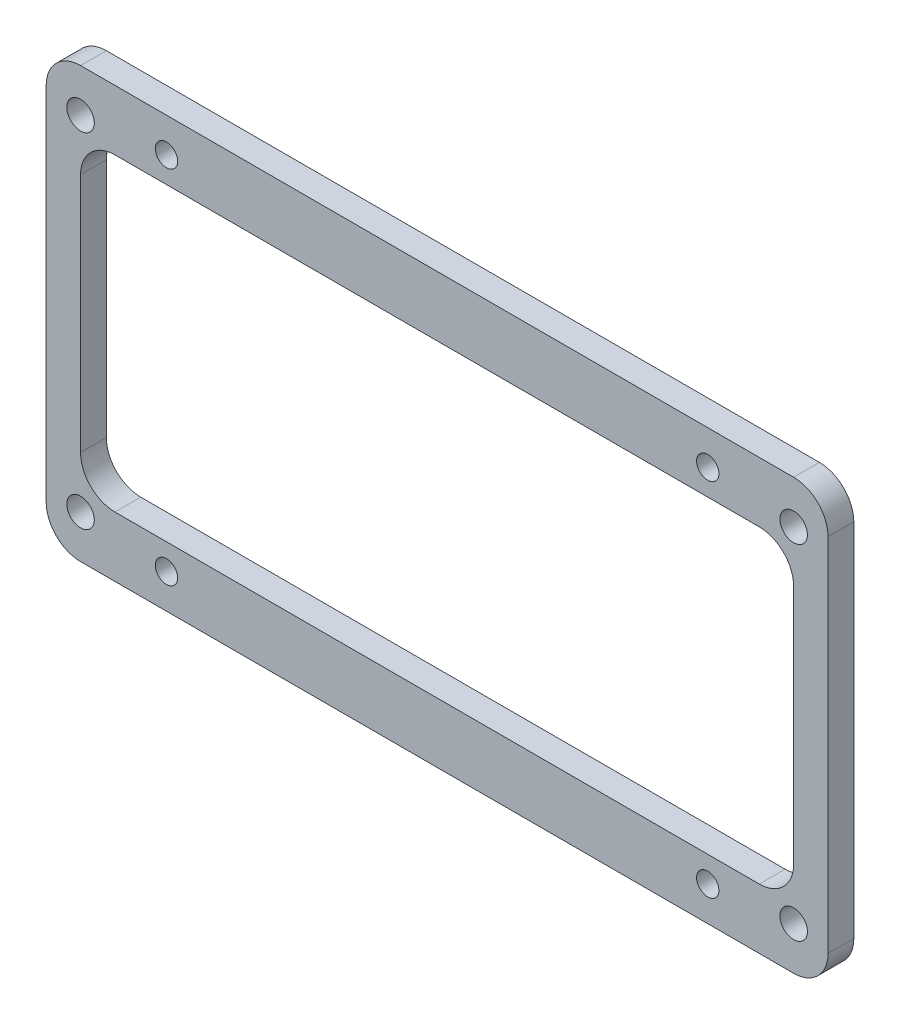
ISO-10303-21;
HEADER;
FILE_DESCRIPTION(('STEP AP214'),'2;1');
FILE_NAME('part.step','',(''),(''),'','','');
FILE_SCHEMA(('AUTOMOTIVE_DESIGN { 1 0 10303 214 1 1 1 1 }'));
ENDSEC;
DATA;
#1=APPLICATION_CONTEXT('core data for automotive mechanical design processes');
#2=APPLICATION_PROTOCOL_DEFINITION('international standard','automotive_design',2000,#1);
#3=PRODUCT_CONTEXT('',#1,'mechanical');
#4=PRODUCT('Part','Part','',(#3));
#5=PRODUCT_RELATED_PRODUCT_CATEGORY('part','',(#4));
#6=PRODUCT_DEFINITION_FORMATION('','',#4);
#7=PRODUCT_DEFINITION_CONTEXT('part definition',#1,'design');
#8=PRODUCT_DEFINITION('design','',#6,#7);
#9=PRODUCT_DEFINITION_SHAPE('','',#8);
#10=(LENGTH_UNIT() NAMED_UNIT(*) SI_UNIT(.MILLI.,.METRE.));
#11=(NAMED_UNIT(*) PLANE_ANGLE_UNIT() SI_UNIT($,.RADIAN.));
#12=(NAMED_UNIT(*) SI_UNIT($,.STERADIAN.) SOLID_ANGLE_UNIT());
#13=UNCERTAINTY_MEASURE_WITH_UNIT(LENGTH_MEASURE(1.E-05),#10,'distance_accuracy_value','');
#14=(GEOMETRIC_REPRESENTATION_CONTEXT(3) GLOBAL_UNCERTAINTY_ASSIGNED_CONTEXT((#13)) GLOBAL_UNIT_ASSIGNED_CONTEXT((#10,
#11,#12)) REPRESENTATION_CONTEXT('',''));
#15=CARTESIAN_POINT('',(0.,0.,0.));
#16=DIRECTION('',(0.,0.,1.));
#17=DIRECTION('',(1.,0.,0.));
#18=AXIS2_PLACEMENT_3D('',#15,#16,#17);
#19=CARTESIAN_POINT('',(0.,0.,3.));
#20=DIRECTION('',(0.,0.,-1.));
#21=DIRECTION('',(-1.,0.,0.));
#22=AXIS2_PLACEMENT_3D('',#19,#20,#21);
#23=PLANE('',#22);
#24=CARTESIAN_POINT('',(-41.5,20.,3.));
#25=DIRECTION('',(0.,0.,1.));
#26=DIRECTION('',(1.,0.,0.));
#27=AXIS2_PLACEMENT_3D('',#24,#25,#26);
#28=CIRCLE('',#27,1.6);
#29=CARTESIAN_POINT('',(-39.9,20.,3.));
#30=VERTEX_POINT('',#29);
#31=EDGE_CURVE('E395',#30,#30,#28,.T.);
#32=ORIENTED_EDGE('',*,*,#31,.F.);
#33=EDGE_LOOP('',(#32));
#34=FACE_BOUND('',#33,.T.);
#35=CARTESIAN_POINT('',(-41.5,-20.,3.));
#36=DIRECTION('',(0.,0.,1.));
#37=DIRECTION('',(1.,0.,0.));
#38=AXIS2_PLACEMENT_3D('',#35,#36,#37);
#39=CIRCLE('',#38,1.6);
#40=CARTESIAN_POINT('',(-39.9,-20.,3.));
#41=VERTEX_POINT('',#40);
#42=EDGE_CURVE('E401',#41,#41,#39,.T.);
#43=ORIENTED_EDGE('',*,*,#42,.F.);
#44=EDGE_LOOP('',(#43));
#45=FACE_BOUND('',#44,.T.);
#46=CARTESIAN_POINT('',(41.5,-20.,3.));
#47=DIRECTION('',(0.,0.,1.));
#48=DIRECTION('',(1.,0.,0.));
#49=AXIS2_PLACEMENT_3D('',#46,#47,#48);
#50=CIRCLE('',#49,1.6);
#51=CARTESIAN_POINT('',(43.1,-20.,3.));
#52=VERTEX_POINT('',#51);
#53=EDGE_CURVE('E407',#52,#52,#50,.T.);
#54=ORIENTED_EDGE('',*,*,#53,.F.);
#55=EDGE_LOOP('',(#54));
#56=FACE_BOUND('',#55,.T.);
#57=CARTESIAN_POINT('',(41.5,20.,3.));
#58=DIRECTION('',(0.,0.,1.));
#59=DIRECTION('',(1.,0.,0.));
#60=AXIS2_PLACEMENT_3D('',#57,#58,#59);
#61=CIRCLE('',#60,1.6);
#62=CARTESIAN_POINT('',(43.1,20.,3.));
#63=VERTEX_POINT('',#62);
#64=EDGE_CURVE('E389',#63,#63,#61,.T.);
#65=ORIENTED_EDGE('',*,*,#64,.F.);
#66=EDGE_LOOP('',(#65));
#67=FACE_BOUND('',#66,.T.);
#68=CARTESIAN_POINT('',(-31.5,21.,3.));
#69=DIRECTION('',(0.,0.,1.));
#70=DIRECTION('',(1.,0.,0.));
#71=AXIS2_PLACEMENT_3D('',#68,#69,#70);
#72=CIRCLE('',#71,1.3);
#73=CARTESIAN_POINT('',(-30.2,21.,3.));
#74=VERTEX_POINT('',#73);
#75=EDGE_CURVE('E371',#74,#74,#72,.T.);
#76=ORIENTED_EDGE('',*,*,#75,.F.);
#77=EDGE_LOOP('',(#76));
#78=FACE_BOUND('',#77,.T.);
#79=CARTESIAN_POINT('',(-31.5,-21.,3.));
#80=DIRECTION('',(0.,0.,1.));
#81=DIRECTION('',(1.,0.,0.));
#82=AXIS2_PLACEMENT_3D('',#79,#80,#81);
#83=CIRCLE('',#82,1.3);
#84=CARTESIAN_POINT('',(-30.2,-21.,3.));
#85=VERTEX_POINT('',#84);
#86=EDGE_CURVE('E378',#85,#85,#83,.T.);
#87=ORIENTED_EDGE('',*,*,#86,.F.);
#88=EDGE_LOOP('',(#87));
#89=FACE_BOUND('',#88,.T.);
#90=CARTESIAN_POINT('',(31.5,-21.,3.));
#91=DIRECTION('',(0.,0.,1.));
#92=DIRECTION('',(1.,0.,0.));
#93=AXIS2_PLACEMENT_3D('',#90,#91,#92);
#94=CIRCLE('',#93,1.3);
#95=CARTESIAN_POINT('',(32.8,-21.,3.));
#96=VERTEX_POINT('',#95);
#97=EDGE_CURVE('E384',#96,#96,#94,.T.);
#98=ORIENTED_EDGE('',*,*,#97,.F.);
#99=EDGE_LOOP('',(#98));
#100=FACE_BOUND('',#99,.T.);
#101=CARTESIAN_POINT('',(31.5,21.,3.));
#102=DIRECTION('',(0.,0.,1.));
#103=DIRECTION('',(1.,0.,0.));
#104=AXIS2_PLACEMENT_3D('',#101,#102,#103);
#105=CIRCLE('',#104,1.3);
#106=CARTESIAN_POINT('',(32.8,21.,3.));
#107=VERTEX_POINT('',#106);
#108=EDGE_CURVE('E365',#107,#107,#105,.T.);
#109=ORIENTED_EDGE('',*,*,#108,.F.);
#110=EDGE_LOOP('',(#109));
#111=FACE_BOUND('',#110,.T.);
#112=DIRECTION('',(0.,1.,0.));
#113=VECTOR('',#112,1.);
#114=CARTESIAN_POINT('',(45.5,-25.,3.));
#115=LINE('',#114,#113);
#116=CARTESIAN_POINT('',(45.5,-21.,3.));
#117=VERTEX_POINT('',#116);
#118=CARTESIAN_POINT('',(45.5,21.,3.));
#119=VERTEX_POINT('',#118);
#120=EDGE_CURVE('E264',#117,#119,#115,.T.);
#121=ORIENTED_EDGE('',*,*,#120,.T.);
#122=CARTESIAN_POINT('',(41.5,21.,3.));
#123=DIRECTION('',(0.,0.,-1.));
#124=DIRECTION('',(-1.,0.,0.));
#125=AXIS2_PLACEMENT_3D('',#122,#123,#124);
#126=CIRCLE('',#125,4.);
#127=CARTESIAN_POINT('',(41.5,25.,3.));
#128=VERTEX_POINT('',#127);
#129=EDGE_CURVE('E208',#119,#128,#126,.F.);
#130=ORIENTED_EDGE('',*,*,#129,.T.);
#131=DIRECTION('',(-1.,0.,0.));
#132=VECTOR('',#131,1.);
#133=CARTESIAN_POINT('',(-45.5,25.,3.));
#134=LINE('',#133,#132);
#135=CARTESIAN_POINT('',(-41.5,25.,3.));
#136=VERTEX_POINT('',#135);
#137=EDGE_CURVE('E266',#128,#136,#134,.T.);
#138=ORIENTED_EDGE('',*,*,#137,.T.);
#139=CARTESIAN_POINT('',(-41.5,21.,3.));
#140=DIRECTION('',(0.,0.,-1.));
#141=DIRECTION('',(-1.,0.,0.));
#142=AXIS2_PLACEMENT_3D('',#139,#140,#141);
#143=CIRCLE('',#142,4.);
#144=CARTESIAN_POINT('',(-45.5,21.,3.));
#145=VERTEX_POINT('',#144);
#146=EDGE_CURVE('E210',#136,#145,#143,.F.);
#147=ORIENTED_EDGE('',*,*,#146,.T.);
#148=DIRECTION('',(0.,-1.,0.));
#149=VECTOR('',#148,1.);
#150=CARTESIAN_POINT('',(-45.5,-25.,3.));
#151=LINE('',#150,#149);
#152=CARTESIAN_POINT('',(-45.5,-21.,3.));
#153=VERTEX_POINT('',#152);
#154=EDGE_CURVE('E170',#145,#153,#151,.T.);
#155=ORIENTED_EDGE('',*,*,#154,.T.);
#156=CARTESIAN_POINT('',(-41.5,-21.,3.));
#157=DIRECTION('',(0.,0.,-1.));
#158=DIRECTION('',(-1.,0.,0.));
#159=AXIS2_PLACEMENT_3D('',#156,#157,#158);
#160=CIRCLE('',#159,4.);
#161=CARTESIAN_POINT('',(-41.5,-25.,3.));
#162=VERTEX_POINT('',#161);
#163=EDGE_CURVE('E212',#153,#162,#160,.F.);
#164=ORIENTED_EDGE('',*,*,#163,.T.);
#165=DIRECTION('',(1.,0.,0.));
#166=VECTOR('',#165,1.);
#167=CARTESIAN_POINT('',(-45.5,-25.,3.));
#168=LINE('',#167,#166);
#169=CARTESIAN_POINT('',(41.5,-25.,3.));
#170=VERTEX_POINT('',#169);
#171=EDGE_CURVE('E166',#162,#170,#168,.T.);
#172=ORIENTED_EDGE('',*,*,#171,.T.);
#173=CARTESIAN_POINT('',(41.5,-21.,3.));
#174=DIRECTION('',(0.,0.,-1.));
#175=DIRECTION('',(-1.,0.,0.));
#176=AXIS2_PLACEMENT_3D('',#173,#174,#175);
#177=CIRCLE('',#176,4.);
#178=EDGE_CURVE('E214',#170,#117,#177,.F.);
#179=ORIENTED_EDGE('',*,*,#178,.T.);
#180=EDGE_LOOP('',(#121,#130,#138,#147,#155,#164,#172,#179));
#181=FACE_BOUND('',#180,.T.);
#182=DIRECTION('',(0.,1.,0.));
#183=VECTOR('',#182,1.);
#184=CARTESIAN_POINT('',(41.5,-18.,3.));
#185=LINE('',#184,#183);
#186=CARTESIAN_POINT('',(41.5,-14.,3.));
#187=VERTEX_POINT('',#186);
#188=CARTESIAN_POINT('',(41.5,14.,3.));
#189=VERTEX_POINT('',#188);
#190=EDGE_CURVE('E243',#187,#189,#185,.T.);
#191=ORIENTED_EDGE('',*,*,#190,.F.);
#192=CARTESIAN_POINT('',(37.5,-14.,3.));
#193=DIRECTION('',(0.,0.,-1.));
#194=DIRECTION('',(-1.,0.,0.));
#195=AXIS2_PLACEMENT_3D('',#192,#193,#194);
#196=CIRCLE('',#195,4.);
#197=CARTESIAN_POINT('',(37.5,-18.,3.));
#198=VERTEX_POINT('',#197);
#199=EDGE_CURVE('E236',#187,#198,#196,.T.);
#200=ORIENTED_EDGE('',*,*,#199,.T.);
#201=DIRECTION('',(1.,0.,0.));
#202=VECTOR('',#201,1.);
#203=CARTESIAN_POINT('',(-41.5,-18.,3.));
#204=LINE('',#203,#202);
#205=CARTESIAN_POINT('',(-37.5,-18.,3.));
#206=VERTEX_POINT('',#205);
#207=EDGE_CURVE('E273',#206,#198,#204,.T.);
#208=ORIENTED_EDGE('',*,*,#207,.F.);
#209=CARTESIAN_POINT('',(-37.5,-14.,3.));
#210=DIRECTION('',(0.,0.,-1.));
#211=DIRECTION('',(-1.,0.,0.));
#212=AXIS2_PLACEMENT_3D('',#209,#210,#211);
#213=CIRCLE('',#212,4.);
#214=CARTESIAN_POINT('',(-41.5,-14.,3.));
#215=VERTEX_POINT('',#214);
#216=EDGE_CURVE('E232',#206,#215,#213,.T.);
#217=ORIENTED_EDGE('',*,*,#216,.T.);
#218=DIRECTION('',(0.,-1.,0.));
#219=VECTOR('',#218,1.);
#220=CARTESIAN_POINT('',(-41.5,-18.,3.));
#221=LINE('',#220,#219);
#222=CARTESIAN_POINT('',(-41.5,14.,3.));
#223=VERTEX_POINT('',#222);
#224=EDGE_CURVE('E361',#223,#215,#221,.T.);
#225=ORIENTED_EDGE('',*,*,#224,.F.);
#226=CARTESIAN_POINT('',(-37.5,14.,3.));
#227=DIRECTION('',(0.,0.,-1.));
#228=DIRECTION('',(-1.,0.,0.));
#229=AXIS2_PLACEMENT_3D('',#226,#227,#228);
#230=CIRCLE('',#229,4.);
#231=CARTESIAN_POINT('',(-37.5,18.,3.));
#232=VERTEX_POINT('',#231);
#233=EDGE_CURVE('E11',#223,#232,#230,.T.);
#234=ORIENTED_EDGE('',*,*,#233,.T.);
#235=DIRECTION('',(-1.,0.,0.));
#236=VECTOR('',#235,1.);
#237=CARTESIAN_POINT('',(-41.5,18.,3.));
#238=LINE('',#237,#236);
#239=CARTESIAN_POINT('',(37.5,18.,3.));
#240=VERTEX_POINT('',#239);
#241=EDGE_CURVE('E245',#240,#232,#238,.T.);
#242=ORIENTED_EDGE('',*,*,#241,.F.);
#243=CARTESIAN_POINT('',(37.5,14.,3.));
#244=DIRECTION('',(0.,0.,-1.));
#245=DIRECTION('',(-1.,0.,0.));
#246=AXIS2_PLACEMENT_3D('',#243,#244,#245);
#247=CIRCLE('',#246,4.);
#248=EDGE_CURVE('E156',#240,#189,#247,.T.);
#249=ORIENTED_EDGE('',*,*,#248,.T.);
#250=EDGE_LOOP('',(#191,#200,#208,#217,#225,#234,#242,#249));
#251=FACE_BOUND('',#250,.T.);
#252=ADVANCED_FACE('F35',(#34,#45,#56,#67,#78,#89,#100,#111,#181,#251),#23,.F.);
#253=CARTESIAN_POINT('',(0.,0.,0.));
#254=DIRECTION('',(0.,0.,-1.));
#255=DIRECTION('',(-1.,0.,0.));
#256=AXIS2_PLACEMENT_3D('',#253,#254,#255);
#257=PLANE('',#256);
#258=CARTESIAN_POINT('',(41.5,21.,0.));
#259=DIRECTION('',(0.,0.,-1.));
#260=DIRECTION('',(-1.,0.,0.));
#261=AXIS2_PLACEMENT_3D('',#258,#259,#260);
#262=CIRCLE('',#261,4.);
#263=CARTESIAN_POINT('',(41.5,25.,0.));
#264=VERTEX_POINT('',#263);
#265=CARTESIAN_POINT('',(45.5,21.,0.));
#266=VERTEX_POINT('',#265);
#267=EDGE_CURVE('E191',#264,#266,#262,.T.);
#268=ORIENTED_EDGE('',*,*,#267,.T.);
#269=DIRECTION('',(0.,1.,0.));
#270=VECTOR('',#269,1.);
#271=CARTESIAN_POINT('',(45.5,-25.,0.));
#272=LINE('',#271,#270);
#273=CARTESIAN_POINT('',(45.5,-21.,0.));
#274=VERTEX_POINT('',#273);
#275=EDGE_CURVE('E270',#274,#266,#272,.T.);
#276=ORIENTED_EDGE('',*,*,#275,.F.);
#277=CARTESIAN_POINT('',(41.5,-21.,0.));
#278=DIRECTION('',(0.,0.,-1.));
#279=DIRECTION('',(-1.,0.,0.));
#280=AXIS2_PLACEMENT_3D('',#277,#278,#279);
#281=CIRCLE('',#280,4.);
#282=CARTESIAN_POINT('',(41.5,-25.,0.));
#283=VERTEX_POINT('',#282);
#284=EDGE_CURVE('E199',#274,#283,#281,.T.);
#285=ORIENTED_EDGE('',*,*,#284,.T.);
#286=DIRECTION('',(1.,0.,0.));
#287=VECTOR('',#286,1.);
#288=CARTESIAN_POINT('',(-45.5,-25.,0.));
#289=LINE('',#288,#287);
#290=CARTESIAN_POINT('',(-41.5,-25.,0.));
#291=VERTEX_POINT('',#290);
#292=EDGE_CURVE('E173',#291,#283,#289,.T.);
#293=ORIENTED_EDGE('',*,*,#292,.F.);
#294=CARTESIAN_POINT('',(-41.5,-21.,0.));
#295=DIRECTION('',(0.,0.,-1.));
#296=DIRECTION('',(-1.,0.,0.));
#297=AXIS2_PLACEMENT_3D('',#294,#295,#296);
#298=CIRCLE('',#297,4.);
#299=CARTESIAN_POINT('',(-45.5,-21.,0.));
#300=VERTEX_POINT('',#299);
#301=EDGE_CURVE('E197',#291,#300,#298,.T.);
#302=ORIENTED_EDGE('',*,*,#301,.T.);
#303=DIRECTION('',(0.,-1.,0.));
#304=VECTOR('',#303,1.);
#305=CARTESIAN_POINT('',(-45.5,-25.,0.));
#306=LINE('',#305,#304);
#307=CARTESIAN_POINT('',(-45.5,21.,0.));
#308=VERTEX_POINT('',#307);
#309=EDGE_CURVE('E274',#308,#300,#306,.T.);
#310=ORIENTED_EDGE('',*,*,#309,.F.);
#311=CARTESIAN_POINT('',(-41.5,21.,0.));
#312=DIRECTION('',(0.,0.,-1.));
#313=DIRECTION('',(-1.,0.,0.));
#314=AXIS2_PLACEMENT_3D('',#311,#312,#313);
#315=CIRCLE('',#314,4.);
#316=CARTESIAN_POINT('',(-41.5,25.,0.));
#317=VERTEX_POINT('',#316);
#318=EDGE_CURVE('E194',#308,#317,#315,.T.);
#319=ORIENTED_EDGE('',*,*,#318,.T.);
#320=DIRECTION('',(-1.,0.,0.));
#321=VECTOR('',#320,1.);
#322=CARTESIAN_POINT('',(-45.5,25.,0.));
#323=LINE('',#322,#321);
#324=EDGE_CURVE('E272',#264,#317,#323,.T.);
#325=ORIENTED_EDGE('',*,*,#324,.F.);
#326=EDGE_LOOP('',(#268,#276,#285,#293,#302,#310,#319,#325));
#327=FACE_BOUND('',#326,.T.);
#328=CARTESIAN_POINT('',(-41.5,20.,0.));
#329=DIRECTION('',(0.,0.,1.));
#330=DIRECTION('',(1.,0.,0.));
#331=AXIS2_PLACEMENT_3D('',#328,#329,#330);
#332=CIRCLE('',#331,1.6);
#333=CARTESIAN_POINT('',(-39.9,20.,0.));
#334=VERTEX_POINT('',#333);
#335=EDGE_CURVE('E398',#334,#334,#332,.T.);
#336=ORIENTED_EDGE('',*,*,#335,.T.);
#337=EDGE_LOOP('',(#336));
#338=FACE_BOUND('',#337,.T.);
#339=CARTESIAN_POINT('',(-41.5,-20.,0.));
#340=DIRECTION('',(0.,0.,1.));
#341=DIRECTION('',(1.,0.,0.));
#342=AXIS2_PLACEMENT_3D('',#339,#340,#341);
#343=CIRCLE('',#342,1.6);
#344=CARTESIAN_POINT('',(-39.9,-20.,0.));
#345=VERTEX_POINT('',#344);
#346=EDGE_CURVE('E404',#345,#345,#343,.T.);
#347=ORIENTED_EDGE('',*,*,#346,.T.);
#348=EDGE_LOOP('',(#347));
#349=FACE_BOUND('',#348,.T.);
#350=CARTESIAN_POINT('',(41.5,-20.,0.));
#351=DIRECTION('',(0.,0.,1.));
#352=DIRECTION('',(1.,0.,0.));
#353=AXIS2_PLACEMENT_3D('',#350,#351,#352);
#354=CIRCLE('',#353,1.6);
#355=CARTESIAN_POINT('',(43.1,-20.,0.));
#356=VERTEX_POINT('',#355);
#357=EDGE_CURVE('E392',#356,#356,#354,.T.);
#358=ORIENTED_EDGE('',*,*,#357,.T.);
#359=EDGE_LOOP('',(#358));
#360=FACE_BOUND('',#359,.T.);
#361=CARTESIAN_POINT('',(41.5,20.,0.));
#362=DIRECTION('',(0.,0.,1.));
#363=DIRECTION('',(1.,0.,0.));
#364=AXIS2_PLACEMENT_3D('',#361,#362,#363);
#365=CIRCLE('',#364,1.6);
#366=CARTESIAN_POINT('',(43.1,20.,0.));
#367=VERTEX_POINT('',#366);
#368=EDGE_CURVE('E375',#367,#367,#365,.T.);
#369=ORIENTED_EDGE('',*,*,#368,.T.);
#370=EDGE_LOOP('',(#369));
#371=FACE_BOUND('',#370,.T.);
#372=CARTESIAN_POINT('',(-31.5,21.,0.));
#373=DIRECTION('',(0.,0.,1.));
#374=DIRECTION('',(1.,0.,0.));
#375=AXIS2_PLACEMENT_3D('',#372,#373,#374);
#376=CIRCLE('',#375,1.3);
#377=CARTESIAN_POINT('',(-30.2,21.,0.));
#378=VERTEX_POINT('',#377);
#379=EDGE_CURVE('E374',#378,#378,#376,.T.);
#380=ORIENTED_EDGE('',*,*,#379,.T.);
#381=EDGE_LOOP('',(#380));
#382=FACE_BOUND('',#381,.T.);
#383=CARTESIAN_POINT('',(-31.5,-21.,0.));
#384=DIRECTION('',(0.,0.,1.));
#385=DIRECTION('',(1.,0.,0.));
#386=AXIS2_PLACEMENT_3D('',#383,#384,#385);
#387=CIRCLE('',#386,1.3);
#388=CARTESIAN_POINT('',(-30.2,-21.,0.));
#389=VERTEX_POINT('',#388);
#390=EDGE_CURVE('E381',#389,#389,#387,.T.);
#391=ORIENTED_EDGE('',*,*,#390,.T.);
#392=EDGE_LOOP('',(#391));
#393=FACE_BOUND('',#392,.T.);
#394=CARTESIAN_POINT('',(31.5,-21.,0.));
#395=DIRECTION('',(0.,0.,1.));
#396=DIRECTION('',(1.,0.,0.));
#397=AXIS2_PLACEMENT_3D('',#394,#395,#396);
#398=CIRCLE('',#397,1.3);
#399=CARTESIAN_POINT('',(32.8,-21.,0.));
#400=VERTEX_POINT('',#399);
#401=EDGE_CURVE('E368',#400,#400,#398,.T.);
#402=ORIENTED_EDGE('',*,*,#401,.T.);
#403=EDGE_LOOP('',(#402));
#404=FACE_BOUND('',#403,.T.);
#405=CARTESIAN_POINT('',(31.5,21.,0.));
#406=DIRECTION('',(0.,0.,1.));
#407=DIRECTION('',(1.,0.,0.));
#408=AXIS2_PLACEMENT_3D('',#405,#406,#407);
#409=CIRCLE('',#408,1.3);
#410=CARTESIAN_POINT('',(32.8,21.,0.));
#411=VERTEX_POINT('',#410);
#412=EDGE_CURVE('E258',#411,#411,#409,.T.);
#413=ORIENTED_EDGE('',*,*,#412,.T.);
#414=EDGE_LOOP('',(#413));
#415=FACE_BOUND('',#414,.T.);
#416=DIRECTION('',(0.,-1.,0.));
#417=VECTOR('',#416,1.);
#418=CARTESIAN_POINT('',(-41.5,-18.,0.));
#419=LINE('',#418,#417);
#420=CARTESIAN_POINT('',(-41.5,14.,0.));
#421=VERTEX_POINT('',#420);
#422=CARTESIAN_POINT('',(-41.5,-14.,0.));
#423=VERTEX_POINT('',#422);
#424=EDGE_CURVE('E150',#421,#423,#419,.T.);
#425=ORIENTED_EDGE('',*,*,#424,.T.);
#426=CARTESIAN_POINT('',(-37.5,-14.,0.));
#427=DIRECTION('',(0.,0.,-1.));
#428=DIRECTION('',(-1.,0.,0.));
#429=AXIS2_PLACEMENT_3D('',#426,#427,#428);
#430=CIRCLE('',#429,4.);
#431=CARTESIAN_POINT('',(-37.5,-18.,0.));
#432=VERTEX_POINT('',#431);
#433=EDGE_CURVE('E230',#423,#432,#430,.F.);
#434=ORIENTED_EDGE('',*,*,#433,.T.);
#435=DIRECTION('',(1.,0.,0.));
#436=VECTOR('',#435,1.);
#437=CARTESIAN_POINT('',(-41.5,-18.,0.));
#438=LINE('',#437,#436);
#439=CARTESIAN_POINT('',(37.5,-18.,0.));
#440=VERTEX_POINT('',#439);
#441=EDGE_CURVE('E164',#432,#440,#438,.T.);
#442=ORIENTED_EDGE('',*,*,#441,.T.);
#443=CARTESIAN_POINT('',(37.5,-14.,0.));
#444=DIRECTION('',(0.,0.,-1.));
#445=DIRECTION('',(-1.,0.,0.));
#446=AXIS2_PLACEMENT_3D('',#443,#444,#445);
#447=CIRCLE('',#446,4.);
#448=CARTESIAN_POINT('',(41.5,-14.,0.));
#449=VERTEX_POINT('',#448);
#450=EDGE_CURVE('E234',#440,#449,#447,.F.);
#451=ORIENTED_EDGE('',*,*,#450,.T.);
#452=DIRECTION('',(0.,1.,0.));
#453=VECTOR('',#452,1.);
#454=CARTESIAN_POINT('',(41.5,-18.,0.));
#455=LINE('',#454,#453);
#456=CARTESIAN_POINT('',(41.5,14.,0.));
#457=VERTEX_POINT('',#456);
#458=EDGE_CURVE('E255',#449,#457,#455,.T.);
#459=ORIENTED_EDGE('',*,*,#458,.T.);
#460=CARTESIAN_POINT('',(37.5,14.,0.));
#461=DIRECTION('',(0.,0.,-1.));
#462=DIRECTION('',(-1.,0.,0.));
#463=AXIS2_PLACEMENT_3D('',#460,#461,#462);
#464=CIRCLE('',#463,4.);
#465=CARTESIAN_POINT('',(37.5,18.,0.));
#466=VERTEX_POINT('',#465);
#467=EDGE_CURVE('E238',#457,#466,#464,.F.);
#468=ORIENTED_EDGE('',*,*,#467,.T.);
#469=DIRECTION('',(-1.,0.,0.));
#470=VECTOR('',#469,1.);
#471=CARTESIAN_POINT('',(-41.5,18.,0.));
#472=LINE('',#471,#470);
#473=CARTESIAN_POINT('',(-37.5,18.,0.));
#474=VERTEX_POINT('',#473);
#475=EDGE_CURVE('E151',#466,#474,#472,.T.);
#476=ORIENTED_EDGE('',*,*,#475,.T.);
#477=CARTESIAN_POINT('',(-37.5,14.,0.));
#478=DIRECTION('',(0.,0.,-1.));
#479=DIRECTION('',(-1.,0.,0.));
#480=AXIS2_PLACEMENT_3D('',#477,#478,#479);
#481=CIRCLE('',#480,4.);
#482=EDGE_CURVE('E43',#474,#421,#481,.F.);
#483=ORIENTED_EDGE('',*,*,#482,.T.);
#484=EDGE_LOOP('',(#425,#434,#442,#451,#459,#468,#476,#483));
#485=FACE_BOUND('',#484,.T.);
#486=ADVANCED_FACE('F149',(#327,#338,#349,#360,#371,#382,#393,#404,#415,#485),#257,.T.);
#487=CARTESIAN_POINT('',(45.5,-25.,3.));
#488=DIRECTION('',(-1.,0.,0.));
#489=DIRECTION('',(0.,0.,1.));
#490=AXIS2_PLACEMENT_3D('',#487,#488,#489);
#491=PLANE('',#490);
#492=DIRECTION('',(0.,0.,-1.));
#493=VECTOR('',#492,1.);
#494=CARTESIAN_POINT('',(45.5,21.,3.));
#495=LINE('',#494,#493);
#496=EDGE_CURVE('E185',#266,#119,#495,.F.);
#497=ORIENTED_EDGE('',*,*,#496,.T.);
#498=ORIENTED_EDGE('',*,*,#120,.F.);
#499=DIRECTION('',(0.,0.,-1.));
#500=VECTOR('',#499,1.);
#501=CARTESIAN_POINT('',(45.5,-21.,3.));
#502=LINE('',#501,#500);
#503=EDGE_CURVE('E188',#117,#274,#502,.T.);
#504=ORIENTED_EDGE('',*,*,#503,.T.);
#505=ORIENTED_EDGE('',*,*,#275,.T.);
#506=EDGE_LOOP('',(#497,#498,#504,#505));
#507=FACE_BOUND('',#506,.T.);
#508=ADVANCED_FACE('F295',(#507),#491,.F.);
#509=CARTESIAN_POINT('',(-45.5,25.,3.));
#510=DIRECTION('',(0.,-1.,0.));
#511=DIRECTION('',(0.,0.,-1.));
#512=AXIS2_PLACEMENT_3D('',#509,#510,#511);
#513=PLANE('',#512);
#514=DIRECTION('',(0.,0.,-1.));
#515=VECTOR('',#514,1.);
#516=CARTESIAN_POINT('',(-41.5,25.,3.));
#517=LINE('',#516,#515);
#518=EDGE_CURVE('E224',#317,#136,#517,.F.);
#519=ORIENTED_EDGE('',*,*,#518,.T.);
#520=ORIENTED_EDGE('',*,*,#137,.F.);
#521=DIRECTION('',(0.,0.,-1.));
#522=VECTOR('',#521,1.);
#523=CARTESIAN_POINT('',(41.5,25.,3.));
#524=LINE('',#523,#522);
#525=EDGE_CURVE('E221',#128,#264,#524,.T.);
#526=ORIENTED_EDGE('',*,*,#525,.T.);
#527=ORIENTED_EDGE('',*,*,#324,.T.);
#528=EDGE_LOOP('',(#519,#520,#526,#527));
#529=FACE_BOUND('',#528,.T.);
#530=ADVANCED_FACE('F303',(#529),#513,.F.);
#531=CARTESIAN_POINT('',(-45.5,-25.,3.));
#532=DIRECTION('',(1.,0.,0.));
#533=DIRECTION('',(0.,0.,-1.));
#534=AXIS2_PLACEMENT_3D('',#531,#532,#533);
#535=PLANE('',#534);
#536=ORIENTED_EDGE('',*,*,#309,.T.);
#537=DIRECTION('',(0.,0.,-1.));
#538=VECTOR('',#537,1.);
#539=CARTESIAN_POINT('',(-45.5,-21.,3.));
#540=LINE('',#539,#538);
#541=EDGE_CURVE('E219',#300,#153,#540,.F.);
#542=ORIENTED_EDGE('',*,*,#541,.T.);
#543=ORIENTED_EDGE('',*,*,#154,.F.);
#544=DIRECTION('',(0.,0.,-1.));
#545=VECTOR('',#544,1.);
#546=CARTESIAN_POINT('',(-45.5,21.,3.));
#547=LINE('',#546,#545);
#548=EDGE_CURVE('E216',#145,#308,#547,.T.);
#549=ORIENTED_EDGE('',*,*,#548,.T.);
#550=EDGE_LOOP('',(#536,#542,#543,#549));
#551=FACE_BOUND('',#550,.T.);
#552=ADVANCED_FACE('F312',(#551),#535,.F.);
#553=CARTESIAN_POINT('',(-45.5,-25.,3.));
#554=DIRECTION('',(0.,1.,0.));
#555=DIRECTION('',(0.,0.,1.));
#556=AXIS2_PLACEMENT_3D('',#553,#554,#555);
#557=PLANE('',#556);
#558=DIRECTION('',(0.,0.,-1.));
#559=VECTOR('',#558,1.);
#560=CARTESIAN_POINT('',(41.5,-25.,3.));
#561=LINE('',#560,#559);
#562=EDGE_CURVE('E205',#283,#170,#561,.F.);
#563=ORIENTED_EDGE('',*,*,#562,.T.);
#564=ORIENTED_EDGE('',*,*,#171,.F.);
#565=DIRECTION('',(0.,0.,-1.));
#566=VECTOR('',#565,1.);
#567=CARTESIAN_POINT('',(-41.5,-25.,3.));
#568=LINE('',#567,#566);
#569=EDGE_CURVE('E202',#162,#291,#568,.T.);
#570=ORIENTED_EDGE('',*,*,#569,.T.);
#571=ORIENTED_EDGE('',*,*,#292,.T.);
#572=EDGE_LOOP('',(#563,#564,#570,#571));
#573=FACE_BOUND('',#572,.T.);
#574=ADVANCED_FACE('F281',(#573),#557,.F.);
#575=CARTESIAN_POINT('',(41.5,-18.,3.));
#576=DIRECTION('',(-1.,0.,0.));
#577=DIRECTION('',(0.,0.,1.));
#578=AXIS2_PLACEMENT_3D('',#575,#576,#577);
#579=PLANE('',#578);
#580=ORIENTED_EDGE('',*,*,#458,.F.);
#581=DIRECTION('',(0.,0.,-1.));
#582=VECTOR('',#581,1.);
#583=CARTESIAN_POINT('',(41.5,-14.,3.));
#584=LINE('',#583,#582);
#585=EDGE_CURVE('E183',#449,#187,#584,.F.);
#586=ORIENTED_EDGE('',*,*,#585,.T.);
#587=ORIENTED_EDGE('',*,*,#190,.T.);
#588=DIRECTION('',(0.,0.,-1.));
#589=VECTOR('',#588,1.);
#590=CARTESIAN_POINT('',(41.5,14.,0.));
#591=LINE('',#590,#589);
#592=EDGE_CURVE('E180',#189,#457,#591,.T.);
#593=ORIENTED_EDGE('',*,*,#592,.T.);
#594=EDGE_LOOP('',(#580,#586,#587,#593));
#595=FACE_BOUND('',#594,.T.);
#596=ADVANCED_FACE('F250',(#595),#579,.T.);
#597=CARTESIAN_POINT('',(-41.5,18.,3.));
#598=DIRECTION('',(0.,-1.,0.));
#599=DIRECTION('',(0.,0.,-1.));
#600=AXIS2_PLACEMENT_3D('',#597,#598,#599);
#601=PLANE('',#600);
#602=ORIENTED_EDGE('',*,*,#475,.F.);
#603=DIRECTION('',(0.,0.,-1.));
#604=VECTOR('',#603,1.);
#605=CARTESIAN_POINT('',(37.5,18.,3.));
#606=LINE('',#605,#604);
#607=EDGE_CURVE('E55',#466,#240,#606,.F.);
#608=ORIENTED_EDGE('',*,*,#607,.T.);
#609=ORIENTED_EDGE('',*,*,#241,.T.);
#610=DIRECTION('',(0.,0.,-1.));
#611=VECTOR('',#610,1.);
#612=CARTESIAN_POINT('',(-37.5,18.,0.));
#613=LINE('',#612,#611);
#614=EDGE_CURVE('E227',#232,#474,#613,.T.);
#615=ORIENTED_EDGE('',*,*,#614,.T.);
#616=EDGE_LOOP('',(#602,#608,#609,#615));
#617=FACE_BOUND('',#616,.T.);
#618=ADVANCED_FACE('F256',(#617),#601,.T.);
#619=CARTESIAN_POINT('',(-41.5,-18.,3.));
#620=DIRECTION('',(1.,0.,0.));
#621=DIRECTION('',(0.,0.,-1.));
#622=AXIS2_PLACEMENT_3D('',#619,#620,#621);
#623=PLANE('',#622);
#624=ORIENTED_EDGE('',*,*,#224,.T.);
#625=DIRECTION('',(0.,0.,-1.));
#626=VECTOR('',#625,1.);
#627=CARTESIAN_POINT('',(-41.5,-14.,0.));
#628=LINE('',#627,#626);
#629=EDGE_CURVE('E163',#215,#423,#628,.T.);
#630=ORIENTED_EDGE('',*,*,#629,.T.);
#631=ORIENTED_EDGE('',*,*,#424,.F.);
#632=DIRECTION('',(0.,0.,-1.));
#633=VECTOR('',#632,1.);
#634=CARTESIAN_POINT('',(-41.5,14.,3.));
#635=LINE('',#634,#633);
#636=EDGE_CURVE('E161',#421,#223,#635,.F.);
#637=ORIENTED_EDGE('',*,*,#636,.T.);
#638=EDGE_LOOP('',(#624,#630,#631,#637));
#639=FACE_BOUND('',#638,.T.);
#640=ADVANCED_FACE('F160',(#639),#623,.T.);
#641=CARTESIAN_POINT('',(-41.5,-18.,3.));
#642=DIRECTION('',(0.,1.,0.));
#643=DIRECTION('',(0.,0.,1.));
#644=AXIS2_PLACEMENT_3D('',#641,#642,#643);
#645=PLANE('',#644);
#646=ORIENTED_EDGE('',*,*,#441,.F.);
#647=DIRECTION('',(0.,0.,-1.));
#648=VECTOR('',#647,1.);
#649=CARTESIAN_POINT('',(-37.5,-18.,3.));
#650=LINE('',#649,#648);
#651=EDGE_CURVE('E178',#432,#206,#650,.F.);
#652=ORIENTED_EDGE('',*,*,#651,.T.);
#653=ORIENTED_EDGE('',*,*,#207,.T.);
#654=DIRECTION('',(0.,0.,-1.));
#655=VECTOR('',#654,1.);
#656=CARTESIAN_POINT('',(37.5,-18.,0.));
#657=LINE('',#656,#655);
#658=EDGE_CURVE('E168',#198,#440,#657,.T.);
#659=ORIENTED_EDGE('',*,*,#658,.T.);
#660=EDGE_LOOP('',(#646,#652,#653,#659));
#661=FACE_BOUND('',#660,.T.);
#662=ADVANCED_FACE('F359',(#661),#645,.T.);
#663=CARTESIAN_POINT('',(31.5,21.,0.));
#664=DIRECTION('',(0.,0.,1.));
#665=DIRECTION('',(1.,0.,0.));
#666=AXIS2_PLACEMENT_3D('',#663,#664,#665);
#667=CYLINDRICAL_SURFACE('',#666,1.3);
#668=ORIENTED_EDGE('',*,*,#412,.F.);
#669=EDGE_LOOP('',(#668));
#670=FACE_BOUND('',#669,.T.);
#671=ORIENTED_EDGE('',*,*,#108,.T.);
#672=EDGE_LOOP('',(#671));
#673=FACE_BOUND('',#672,.T.);
#674=ADVANCED_FACE('F434',(#670,#673),#667,.F.);
#675=CARTESIAN_POINT('',(31.5,-21.,0.));
#676=DIRECTION('',(0.,0.,1.));
#677=DIRECTION('',(1.,0.,0.));
#678=AXIS2_PLACEMENT_3D('',#675,#676,#677);
#679=CYLINDRICAL_SURFACE('',#678,1.3);
#680=ORIENTED_EDGE('',*,*,#401,.F.);
#681=EDGE_LOOP('',(#680));
#682=FACE_BOUND('',#681,.T.);
#683=ORIENTED_EDGE('',*,*,#97,.T.);
#684=EDGE_LOOP('',(#683));
#685=FACE_BOUND('',#684,.T.);
#686=ADVANCED_FACE('F436',(#682,#685),#679,.F.);
#687=CARTESIAN_POINT('',(-31.5,-21.,0.));
#688=DIRECTION('',(0.,0.,1.));
#689=DIRECTION('',(1.,0.,0.));
#690=AXIS2_PLACEMENT_3D('',#687,#688,#689);
#691=CYLINDRICAL_SURFACE('',#690,1.3);
#692=ORIENTED_EDGE('',*,*,#390,.F.);
#693=EDGE_LOOP('',(#692));
#694=FACE_BOUND('',#693,.T.);
#695=ORIENTED_EDGE('',*,*,#86,.T.);
#696=EDGE_LOOP('',(#695));
#697=FACE_BOUND('',#696,.T.);
#698=ADVANCED_FACE('F443',(#694,#697),#691,.F.);
#699=CARTESIAN_POINT('',(-31.5,21.,0.));
#700=DIRECTION('',(0.,0.,1.));
#701=DIRECTION('',(1.,0.,0.));
#702=AXIS2_PLACEMENT_3D('',#699,#700,#701);
#703=CYLINDRICAL_SURFACE('',#702,1.3);
#704=ORIENTED_EDGE('',*,*,#379,.F.);
#705=EDGE_LOOP('',(#704));
#706=FACE_BOUND('',#705,.T.);
#707=ORIENTED_EDGE('',*,*,#75,.T.);
#708=EDGE_LOOP('',(#707));
#709=FACE_BOUND('',#708,.T.);
#710=ADVANCED_FACE('F449',(#706,#709),#703,.F.);
#711=CARTESIAN_POINT('',(41.5,20.,0.));
#712=DIRECTION('',(0.,0.,1.));
#713=DIRECTION('',(1.,0.,0.));
#714=AXIS2_PLACEMENT_3D('',#711,#712,#713);
#715=CYLINDRICAL_SURFACE('',#714,1.6);
#716=ORIENTED_EDGE('',*,*,#368,.F.);
#717=EDGE_LOOP('',(#716));
#718=FACE_BOUND('',#717,.T.);
#719=ORIENTED_EDGE('',*,*,#64,.T.);
#720=EDGE_LOOP('',(#719));
#721=FACE_BOUND('',#720,.T.);
#722=ADVANCED_FACE('F419',(#718,#721),#715,.F.);
#723=CARTESIAN_POINT('',(41.5,-20.,0.));
#724=DIRECTION('',(0.,0.,1.));
#725=DIRECTION('',(1.,0.,0.));
#726=AXIS2_PLACEMENT_3D('',#723,#724,#725);
#727=CYLINDRICAL_SURFACE('',#726,1.6);
#728=ORIENTED_EDGE('',*,*,#357,.F.);
#729=EDGE_LOOP('',(#728));
#730=FACE_BOUND('',#729,.T.);
#731=ORIENTED_EDGE('',*,*,#53,.T.);
#732=EDGE_LOOP('',(#731));
#733=FACE_BOUND('',#732,.T.);
#734=ADVANCED_FACE('F415',(#730,#733),#727,.F.);
#735=CARTESIAN_POINT('',(-41.5,-20.,0.));
#736=DIRECTION('',(0.,0.,1.));
#737=DIRECTION('',(1.,0.,0.));
#738=AXIS2_PLACEMENT_3D('',#735,#736,#737);
#739=CYLINDRICAL_SURFACE('',#738,1.6);
#740=ORIENTED_EDGE('',*,*,#346,.F.);
#741=EDGE_LOOP('',(#740));
#742=FACE_BOUND('',#741,.T.);
#743=ORIENTED_EDGE('',*,*,#42,.T.);
#744=EDGE_LOOP('',(#743));
#745=FACE_BOUND('',#744,.T.);
#746=ADVANCED_FACE('F418',(#742,#745),#739,.F.);
#747=CARTESIAN_POINT('',(-41.5,20.,0.));
#748=DIRECTION('',(0.,0.,1.));
#749=DIRECTION('',(1.,0.,0.));
#750=AXIS2_PLACEMENT_3D('',#747,#748,#749);
#751=CYLINDRICAL_SURFACE('',#750,1.6);
#752=ORIENTED_EDGE('',*,*,#335,.F.);
#753=EDGE_LOOP('',(#752));
#754=FACE_BOUND('',#753,.T.);
#755=ORIENTED_EDGE('',*,*,#31,.T.);
#756=EDGE_LOOP('',(#755));
#757=FACE_BOUND('',#756,.T.);
#758=ADVANCED_FACE('F347',(#754,#757),#751,.F.);
#759=CARTESIAN_POINT('',(-37.5,-14.,3.));
#760=DIRECTION('',(0.,0.,1.));
#761=DIRECTION('',(1.,0.,0.));
#762=AXIS2_PLACEMENT_3D('',#759,#760,#761);
#763=CYLINDRICAL_SURFACE('',#762,4.);
#764=ORIENTED_EDGE('',*,*,#216,.F.);
#765=ORIENTED_EDGE('',*,*,#651,.F.);
#766=ORIENTED_EDGE('',*,*,#433,.F.);
#767=ORIENTED_EDGE('',*,*,#629,.F.);
#768=EDGE_LOOP('',(#764,#765,#766,#767));
#769=FACE_BOUND('',#768,.T.);
#770=ADVANCED_FACE('F344',(#769),#763,.F.);
#771=CARTESIAN_POINT('',(37.5,-14.,3.));
#772=DIRECTION('',(0.,0.,1.));
#773=DIRECTION('',(1.,0.,0.));
#774=AXIS2_PLACEMENT_3D('',#771,#772,#773);
#775=CYLINDRICAL_SURFACE('',#774,4.);
#776=ORIENTED_EDGE('',*,*,#199,.F.);
#777=ORIENTED_EDGE('',*,*,#585,.F.);
#778=ORIENTED_EDGE('',*,*,#450,.F.);
#779=ORIENTED_EDGE('',*,*,#658,.F.);
#780=EDGE_LOOP('',(#776,#777,#778,#779));
#781=FACE_BOUND('',#780,.T.);
#782=ADVANCED_FACE('F322',(#781),#775,.F.);
#783=CARTESIAN_POINT('',(41.5,-21.,3.));
#784=DIRECTION('',(0.,0.,-1.));
#785=DIRECTION('',(-1.,0.,0.));
#786=AXIS2_PLACEMENT_3D('',#783,#784,#785);
#787=CYLINDRICAL_SURFACE('',#786,4.);
#788=ORIENTED_EDGE('',*,*,#178,.F.);
#789=ORIENTED_EDGE('',*,*,#562,.F.);
#790=ORIENTED_EDGE('',*,*,#284,.F.);
#791=ORIENTED_EDGE('',*,*,#503,.F.);
#792=EDGE_LOOP('',(#788,#789,#790,#791));
#793=FACE_BOUND('',#792,.T.);
#794=ADVANCED_FACE('F291',(#793),#787,.T.);
#795=CARTESIAN_POINT('',(-41.5,-21.,3.));
#796=DIRECTION('',(0.,0.,-1.));
#797=DIRECTION('',(-1.,0.,0.));
#798=AXIS2_PLACEMENT_3D('',#795,#796,#797);
#799=CYLINDRICAL_SURFACE('',#798,4.);
#800=ORIENTED_EDGE('',*,*,#163,.F.);
#801=ORIENTED_EDGE('',*,*,#541,.F.);
#802=ORIENTED_EDGE('',*,*,#301,.F.);
#803=ORIENTED_EDGE('',*,*,#569,.F.);
#804=EDGE_LOOP('',(#800,#801,#802,#803));
#805=FACE_BOUND('',#804,.T.);
#806=ADVANCED_FACE('F314',(#805),#799,.T.);
#807=CARTESIAN_POINT('',(-41.5,21.,3.));
#808=DIRECTION('',(0.,0.,-1.));
#809=DIRECTION('',(-1.,0.,0.));
#810=AXIS2_PLACEMENT_3D('',#807,#808,#809);
#811=CYLINDRICAL_SURFACE('',#810,4.);
#812=ORIENTED_EDGE('',*,*,#146,.F.);
#813=ORIENTED_EDGE('',*,*,#518,.F.);
#814=ORIENTED_EDGE('',*,*,#318,.F.);
#815=ORIENTED_EDGE('',*,*,#548,.F.);
#816=EDGE_LOOP('',(#812,#813,#814,#815));
#817=FACE_BOUND('',#816,.T.);
#818=ADVANCED_FACE('F309',(#817),#811,.T.);
#819=CARTESIAN_POINT('',(41.5,21.,3.));
#820=DIRECTION('',(0.,0.,-1.));
#821=DIRECTION('',(-1.,0.,0.));
#822=AXIS2_PLACEMENT_3D('',#819,#820,#821);
#823=CYLINDRICAL_SURFACE('',#822,4.);
#824=ORIENTED_EDGE('',*,*,#129,.F.);
#825=ORIENTED_EDGE('',*,*,#496,.F.);
#826=ORIENTED_EDGE('',*,*,#267,.F.);
#827=ORIENTED_EDGE('',*,*,#525,.F.);
#828=EDGE_LOOP('',(#824,#825,#826,#827));
#829=FACE_BOUND('',#828,.T.);
#830=ADVANCED_FACE('F300',(#829),#823,.T.);
#831=CARTESIAN_POINT('',(37.5,14.,3.));
#832=DIRECTION('',(0.,0.,1.));
#833=DIRECTION('',(1.,0.,0.));
#834=AXIS2_PLACEMENT_3D('',#831,#832,#833);
#835=CYLINDRICAL_SURFACE('',#834,4.);
#836=ORIENTED_EDGE('',*,*,#248,.F.);
#837=ORIENTED_EDGE('',*,*,#607,.F.);
#838=ORIENTED_EDGE('',*,*,#467,.F.);
#839=ORIENTED_EDGE('',*,*,#592,.F.);
#840=EDGE_LOOP('',(#836,#837,#838,#839));
#841=FACE_BOUND('',#840,.T.);
#842=ADVANCED_FACE('F254',(#841),#835,.F.);
#843=CARTESIAN_POINT('',(-37.5,14.,3.));
#844=DIRECTION('',(0.,0.,1.));
#845=DIRECTION('',(1.,0.,0.));
#846=AXIS2_PLACEMENT_3D('',#843,#844,#845);
#847=CYLINDRICAL_SURFACE('',#846,4.);
#848=ORIENTED_EDGE('',*,*,#233,.F.);
#849=ORIENTED_EDGE('',*,*,#636,.F.);
#850=ORIENTED_EDGE('',*,*,#482,.F.);
#851=ORIENTED_EDGE('',*,*,#614,.F.);
#852=EDGE_LOOP('',(#848,#849,#850,#851));
#853=FACE_BOUND('',#852,.T.);
#854=ADVANCED_FACE('F37',(#853),#847,.F.);
#855=CLOSED_SHELL('',(#252,#486,#508,#530,#552,#574,#596,#618,#640,#662,#674,#686,#698,#710,
#722,#734,#746,#758,#770,#782,#794,#806,#818,#830,#842,#854));
#856=MANIFOLD_SOLID_BREP('B2',#855);
#857=ADVANCED_BREP_SHAPE_REPRESENTATION('',(#18,#856),#14);
#858=SHAPE_DEFINITION_REPRESENTATION(#9,#857);
ENDSEC;
END-ISO-10303-21;
